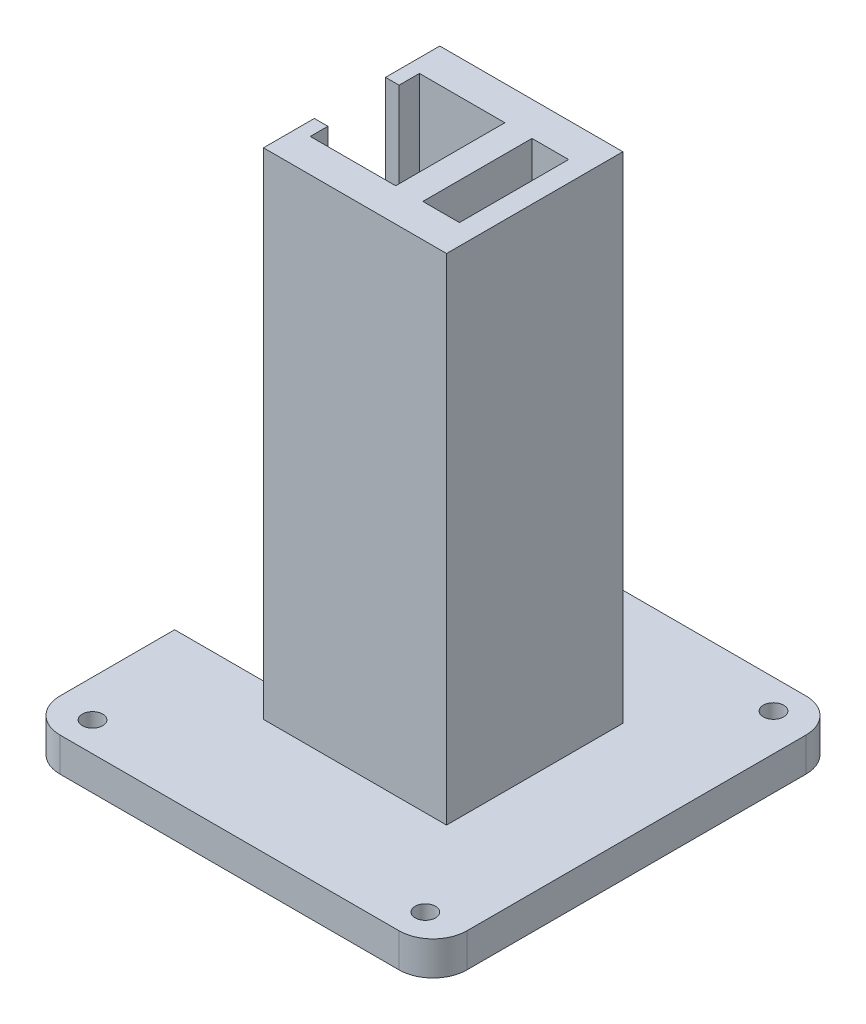
ISO-10303-21;
HEADER;
FILE_DESCRIPTION(('STEP AP214'),'2;1');
FILE_NAME('part.step','',(''),(''),'','','');
FILE_SCHEMA(('AUTOMOTIVE_DESIGN { 1 0 10303 214 1 1 1 1 }'));
ENDSEC;
DATA;
#1=APPLICATION_CONTEXT('core data for automotive mechanical design processes');
#2=APPLICATION_PROTOCOL_DEFINITION('international standard','automotive_design',2000,#1);
#3=PRODUCT_CONTEXT('',#1,'mechanical');
#4=PRODUCT('Part','Part','',(#3));
#5=PRODUCT_RELATED_PRODUCT_CATEGORY('part','',(#4));
#6=PRODUCT_DEFINITION_FORMATION('','',#4);
#7=PRODUCT_DEFINITION_CONTEXT('part definition',#1,'design');
#8=PRODUCT_DEFINITION('design','',#6,#7);
#9=PRODUCT_DEFINITION_SHAPE('','',#8);
#10=(LENGTH_UNIT() NAMED_UNIT(*) SI_UNIT(.MILLI.,.METRE.));
#11=(NAMED_UNIT(*) PLANE_ANGLE_UNIT() SI_UNIT($,.RADIAN.));
#12=(NAMED_UNIT(*) SI_UNIT($,.STERADIAN.) SOLID_ANGLE_UNIT());
#13=UNCERTAINTY_MEASURE_WITH_UNIT(LENGTH_MEASURE(1.E-05),#10,'distance_accuracy_value','');
#14=(GEOMETRIC_REPRESENTATION_CONTEXT(3) GLOBAL_UNCERTAINTY_ASSIGNED_CONTEXT((#13)) GLOBAL_UNIT_ASSIGNED_CONTEXT((#10,
#11,#12)) REPRESENTATION_CONTEXT('',''));
#15=CARTESIAN_POINT('',(0.,0.,0.));
#16=DIRECTION('',(0.,0.,1.));
#17=DIRECTION('',(1.,0.,0.));
#18=AXIS2_PLACEMENT_3D('',#15,#16,#17);
#19=CARTESIAN_POINT('',(-13.,-36.5,5.));
#20=DIRECTION('',(0.,0.,-1.));
#21=DIRECTION('',(-1.,0.,0.));
#22=AXIS2_PLACEMENT_3D('',#19,#20,#21);
#23=PLANE('',#22);
#24=DIRECTION('',(-1.,0.,0.));
#25=VECTOR('',#24,1.);
#26=CARTESIAN_POINT('',(-13.,36.5,5.));
#27=LINE('',#26,#25);
#28=CARTESIAN_POINT('',(12.,36.5,5.));
#29=VERTEX_POINT('',#28);
#30=CARTESIAN_POINT('',(6.60000000000001,36.5,5.));
#31=VERTEX_POINT('',#30);
#32=EDGE_CURVE('E459',#29,#31,#27,.T.);
#33=ORIENTED_EDGE('',*,*,#32,.T.);
#34=DIRECTION('',(0.,1.,0.));
#35=VECTOR('',#34,1.);
#36=CARTESIAN_POINT('',(6.60000000000004,-41.5,5.));
#37=LINE('',#36,#35);
#38=CARTESIAN_POINT('',(6.60000000000004,-41.5,5.));
#39=VERTEX_POINT('',#38);
#40=EDGE_CURVE('E623',#39,#31,#37,.T.);
#41=ORIENTED_EDGE('',*,*,#40,.F.);
#42=DIRECTION('',(-1.,0.,0.));
#43=VECTOR('',#42,1.);
#44=CARTESIAN_POINT('',(12.,-41.5,5.));
#45=LINE('',#44,#43);
#46=CARTESIAN_POINT('',(12.,-41.5,5.));
#47=VERTEX_POINT('',#46);
#48=EDGE_CURVE('E345',#47,#39,#45,.T.);
#49=ORIENTED_EDGE('',*,*,#48,.F.);
#50=DIRECTION('',(0.,1.,0.));
#51=VECTOR('',#50,1.);
#52=CARTESIAN_POINT('',(12.,-36.5,5.));
#53=LINE('',#52,#51);
#54=EDGE_CURVE('E464',#47,#29,#53,.T.);
#55=ORIENTED_EDGE('',*,*,#54,.T.);
#56=EDGE_LOOP('',(#33,#41,#49,#55));
#57=FACE_BOUND('',#56,.T.);
#58=ADVANCED_FACE('F39',(#57),#23,.F.);
#59=CARTESIAN_POINT('',(-13.,-36.5,21.1));
#60=DIRECTION('',(0.,0.,1.));
#61=DIRECTION('',(1.,0.,0.));
#62=AXIS2_PLACEMENT_3D('',#59,#60,#61);
#63=PLANE('',#62);
#64=DIRECTION('',(1.,0.,0.));
#65=VECTOR('',#64,1.);
#66=CARTESIAN_POINT('',(12.,-41.5,21.1));
#67=LINE('',#66,#65);
#68=CARTESIAN_POINT('',(6.60000000000004,-41.5,21.1));
#69=VERTEX_POINT('',#68);
#70=CARTESIAN_POINT('',(12.,-41.5,21.1));
#71=VERTEX_POINT('',#70);
#72=EDGE_CURVE('E249',#69,#71,#67,.T.);
#73=ORIENTED_EDGE('',*,*,#72,.F.);
#74=DIRECTION('',(0.,1.,0.));
#75=VECTOR('',#74,1.);
#76=CARTESIAN_POINT('',(6.60000000000004,-41.5,21.1));
#77=LINE('',#76,#75);
#78=CARTESIAN_POINT('',(6.60000000000001,36.5,21.1));
#79=VERTEX_POINT('',#78);
#80=EDGE_CURVE('E241',#69,#79,#77,.T.);
#81=ORIENTED_EDGE('',*,*,#80,.T.);
#82=DIRECTION('',(1.,0.,0.));
#83=VECTOR('',#82,1.);
#84=CARTESIAN_POINT('',(-13.,36.5,21.1));
#85=LINE('',#84,#83);
#86=CARTESIAN_POINT('',(12.,36.5,21.1));
#87=VERTEX_POINT('',#86);
#88=EDGE_CURVE('E451',#79,#87,#85,.T.);
#89=ORIENTED_EDGE('',*,*,#88,.T.);
#90=DIRECTION('',(0.,1.,0.));
#91=VECTOR('',#90,1.);
#92=CARTESIAN_POINT('',(12.,-36.5,21.1));
#93=LINE('',#92,#91);
#94=EDGE_CURVE('E463',#71,#87,#93,.T.);
#95=ORIENTED_EDGE('',*,*,#94,.F.);
#96=EDGE_LOOP('',(#73,#81,#89,#95));
#97=FACE_BOUND('',#96,.T.);
#98=ADVANCED_FACE('F652',(#97),#63,.F.);
#99=DIRECTION('',(0.,1.,0.));
#100=VECTOR('',#99,1.);
#101=CARTESIAN_POINT('',(-12.,-36.5,21.1));
#102=LINE('',#101,#100);
#103=CARTESIAN_POINT('',(-12.,-41.5,21.1));
#104=VERTEX_POINT('',#103);
#105=CARTESIAN_POINT('',(-12.,-36.5,21.1));
#106=VERTEX_POINT('',#105);
#107=EDGE_CURVE('E258',#104,#106,#102,.T.);
#108=ORIENTED_EDGE('',*,*,#107,.F.);
#109=CARTESIAN_POINT('',(-30.,-41.5,21.1));
#110=VERTEX_POINT('',#109);
#111=EDGE_CURVE('E248',#110,#104,#67,.T.);
#112=ORIENTED_EDGE('',*,*,#111,.F.);
#113=DIRECTION('',(0.,1.,0.));
#114=VECTOR('',#113,1.);
#115=CARTESIAN_POINT('',(-30.,-41.5,21.1));
#116=LINE('',#115,#114);
#117=CARTESIAN_POINT('',(-30.,-36.5,21.1));
#118=VERTEX_POINT('',#117);
#119=EDGE_CURVE('E254',#110,#118,#116,.T.);
#120=ORIENTED_EDGE('',*,*,#119,.T.);
#121=DIRECTION('',(1.,0.,0.));
#122=VECTOR('',#121,1.);
#123=CARTESIAN_POINT('',(12.,-36.5,21.1));
#124=LINE('',#123,#122);
#125=EDGE_CURVE('E255',#118,#106,#124,.T.);
#126=ORIENTED_EDGE('',*,*,#125,.T.);
#127=EDGE_LOOP('',(#108,#112,#120,#126));
#128=FACE_BOUND('',#127,.T.);
#129=ADVANCED_FACE('F615',(#128),#63,.F.);
#130=CARTESIAN_POINT('',(2.60000000000005,-41.5,5.));
#131=VERTEX_POINT('',#130);
#132=CARTESIAN_POINT('',(-9.99999999999999,-41.5,5.));
#133=VERTEX_POINT('',#132);
#134=EDGE_CURVE('E349',#131,#133,#45,.T.);
#135=ORIENTED_EDGE('',*,*,#134,.F.);
#136=DIRECTION('',(0.,1.,0.));
#137=VECTOR('',#136,1.);
#138=CARTESIAN_POINT('',(2.60000000000004,-41.5,5.));
#139=LINE('',#138,#137);
#140=CARTESIAN_POINT('',(2.60000000000001,36.5,5.));
#141=VERTEX_POINT('',#140);
#142=EDGE_CURVE('E228',#131,#141,#139,.T.);
#143=ORIENTED_EDGE('',*,*,#142,.T.);
#144=CARTESIAN_POINT('',(-10.,36.5,5.));
#145=VERTEX_POINT('',#144);
#146=EDGE_CURVE('E458',#141,#145,#27,.T.);
#147=ORIENTED_EDGE('',*,*,#146,.T.);
#148=DIRECTION('',(0.,1.,0.));
#149=VECTOR('',#148,1.);
#150=CARTESIAN_POINT('',(-9.99999999999999,-36.5,5.));
#151=LINE('',#150,#149);
#152=EDGE_CURVE('E432',#133,#145,#151,.T.);
#153=ORIENTED_EDGE('',*,*,#152,.F.);
#154=EDGE_LOOP('',(#135,#143,#147,#153));
#155=FACE_BOUND('',#154,.T.);
#156=ADVANCED_FACE('F656',(#155),#23,.F.);
#157=CARTESIAN_POINT('',(-30.,-41.5,43.));
#158=DIRECTION('',(1.,0.,0.));
#159=DIRECTION('',(0.,1.,0.));
#160=AXIS2_PLACEMENT_3D('',#157,#158,#159);
#161=PLANE('',#160);
#162=DIRECTION('',(0.,0.,-1.));
#163=VECTOR('',#162,1.);
#164=CARTESIAN_POINT('',(-30.,-41.5,43.));
#165=LINE('',#164,#163);
#166=CARTESIAN_POINT('',(-30.,-41.5,5.));
#167=VERTEX_POINT('',#166);
#168=CARTESIAN_POINT('',(-30.,-41.5,-12.));
#169=VERTEX_POINT('',#168);
#170=EDGE_CURVE('E423',#167,#169,#165,.T.);
#171=ORIENTED_EDGE('',*,*,#170,.F.);
#172=DIRECTION('',(0.,-1.,0.));
#173=VECTOR('',#172,1.);
#174=CARTESIAN_POINT('',(-30.,-36.5,5.));
#175=LINE('',#174,#173);
#176=CARTESIAN_POINT('',(-30.,-36.5,5.));
#177=VERTEX_POINT('',#176);
#178=EDGE_CURVE('E336',#177,#167,#175,.T.);
#179=ORIENTED_EDGE('',*,*,#178,.F.);
#180=DIRECTION('',(0.,0.,-1.));
#181=VECTOR('',#180,1.);
#182=CARTESIAN_POINT('',(-30.,-36.5,43.));
#183=LINE('',#182,#181);
#184=CARTESIAN_POINT('',(-30.,-36.5,-12.));
#185=VERTEX_POINT('',#184);
#186=EDGE_CURVE('E440',#177,#185,#183,.T.);
#187=ORIENTED_EDGE('',*,*,#186,.T.);
#188=DIRECTION('',(0.,1.,0.));
#189=VECTOR('',#188,1.);
#190=CARTESIAN_POINT('',(-30.,-41.5,-12.));
#191=LINE('',#190,#189);
#192=EDGE_CURVE('E523',#185,#169,#191,.F.);
#193=ORIENTED_EDGE('',*,*,#192,.T.);
#194=EDGE_LOOP('',(#171,#179,#187,#193));
#195=FACE_BOUND('',#194,.T.);
#196=ADVANCED_FACE('F564',(#195),#161,.F.);
#197=CARTESIAN_POINT('',(15.,-36.5,26.));
#198=DIRECTION('',(-1.,0.,0.));
#199=DIRECTION('',(0.,0.,1.));
#200=AXIS2_PLACEMENT_3D('',#197,#198,#199);
#201=PLANE('',#200);
#202=DIRECTION('',(0.,1.,0.));
#203=VECTOR('',#202,1.);
#204=CARTESIAN_POINT('',(15.,-36.5,0.));
#205=LINE('',#204,#203);
#206=CARTESIAN_POINT('',(15.,-36.5,0.));
#207=VERTEX_POINT('',#206);
#208=CARTESIAN_POINT('',(15.,36.5,0.));
#209=VERTEX_POINT('',#208);
#210=EDGE_CURVE('E485',#207,#209,#205,.T.);
#211=ORIENTED_EDGE('',*,*,#210,.T.);
#212=DIRECTION('',(0.,0.,-1.));
#213=VECTOR('',#212,1.);
#214=CARTESIAN_POINT('',(15.,36.5,26.));
#215=LINE('',#214,#213);
#216=CARTESIAN_POINT('',(15.,36.5,26.));
#217=VERTEX_POINT('',#216);
#218=EDGE_CURVE('E481',#217,#209,#215,.T.);
#219=ORIENTED_EDGE('',*,*,#218,.F.);
#220=DIRECTION('',(0.,1.,0.));
#221=VECTOR('',#220,1.);
#222=CARTESIAN_POINT('',(15.,-36.5,26.));
#223=LINE('',#222,#221);
#224=CARTESIAN_POINT('',(15.,-36.5,26.));
#225=VERTEX_POINT('',#224);
#226=EDGE_CURVE('E474',#225,#217,#223,.T.);
#227=ORIENTED_EDGE('',*,*,#226,.F.);
#228=DIRECTION('',(0.,0.,-1.));
#229=VECTOR('',#228,1.);
#230=CARTESIAN_POINT('',(15.,-36.5,26.));
#231=LINE('',#230,#229);
#232=EDGE_CURVE('E493',#225,#207,#231,.T.);
#233=ORIENTED_EDGE('',*,*,#232,.T.);
#234=EDGE_LOOP('',(#211,#219,#227,#233));
#235=FACE_BOUND('',#234,.T.);
#236=ADVANCED_FACE('F595',(#235),#201,.F.);
#237=CARTESIAN_POINT('',(15.,36.5,26.));
#238=DIRECTION('',(0.,-1.,0.));
#239=DIRECTION('',(1.,0.,0.));
#240=AXIS2_PLACEMENT_3D('',#237,#238,#239);
#241=PLANE('',#240);
#242=ORIENTED_EDGE('',*,*,#146,.F.);
#243=DIRECTION('',(0.,0.,1.));
#244=VECTOR('',#243,1.);
#245=CARTESIAN_POINT('',(2.60000000000001,36.5,5.));
#246=LINE('',#245,#244);
#247=CARTESIAN_POINT('',(2.60000000000001,36.5,21.1));
#248=VERTEX_POINT('',#247);
#249=EDGE_CURVE('E638',#141,#248,#246,.T.);
#250=ORIENTED_EDGE('',*,*,#249,.T.);
#251=CARTESIAN_POINT('',(-9.99999999999999,36.5,21.1));
#252=VERTEX_POINT('',#251);
#253=EDGE_CURVE('E239',#252,#248,#85,.T.);
#254=ORIENTED_EDGE('',*,*,#253,.F.);
#255=DIRECTION('',(0.,0.,-1.));
#256=VECTOR('',#255,1.);
#257=CARTESIAN_POINT('',(-9.99999999999999,36.5,18.5));
#258=LINE('',#257,#256);
#259=CARTESIAN_POINT('',(-9.99999999999999,36.5,18.5));
#260=VERTEX_POINT('',#259);
#261=EDGE_CURVE('E264',#252,#260,#258,.T.);
#262=ORIENTED_EDGE('',*,*,#261,.T.);
#263=DIRECTION('',(-1.,0.,0.));
#264=VECTOR('',#263,1.);
#265=CARTESIAN_POINT('',(-12.,36.5,18.5));
#266=LINE('',#265,#264);
#267=CARTESIAN_POINT('',(-12.,36.5,18.5));
#268=VERTEX_POINT('',#267);
#269=EDGE_CURVE('E278',#260,#268,#266,.T.);
#270=ORIENTED_EDGE('',*,*,#269,.T.);
#271=DIRECTION('',(0.,0.,1.));
#272=VECTOR('',#271,1.);
#273=CARTESIAN_POINT('',(-12.,36.5,26.));
#274=LINE('',#273,#272);
#275=CARTESIAN_POINT('',(-12.,36.5,26.));
#276=VERTEX_POINT('',#275);
#277=EDGE_CURVE('E268',#268,#276,#274,.T.);
#278=ORIENTED_EDGE('',*,*,#277,.T.);
#279=DIRECTION('',(-1.,0.,0.));
#280=VECTOR('',#279,1.);
#281=CARTESIAN_POINT('',(15.,36.5,26.));
#282=LINE('',#281,#280);
#283=EDGE_CURVE('E478',#217,#276,#282,.T.);
#284=ORIENTED_EDGE('',*,*,#283,.F.);
#285=ORIENTED_EDGE('',*,*,#218,.T.);
#286=DIRECTION('',(-1.,0.,0.));
#287=VECTOR('',#286,1.);
#288=CARTESIAN_POINT('',(15.,36.5,0.));
#289=LINE('',#288,#287);
#290=CARTESIAN_POINT('',(-12.,36.5,0.));
#291=VERTEX_POINT('',#290);
#292=EDGE_CURVE('E475',#209,#291,#289,.T.);
#293=ORIENTED_EDGE('',*,*,#292,.T.);
#294=DIRECTION('',(0.,0.,1.));
#295=VECTOR('',#294,1.);
#296=CARTESIAN_POINT('',(-12.,36.5,0.));
#297=LINE('',#296,#295);
#298=CARTESIAN_POINT('',(-12.,36.5,8.));
#299=VERTEX_POINT('',#298);
#300=EDGE_CURVE('E316',#291,#299,#297,.T.);
#301=ORIENTED_EDGE('',*,*,#300,.T.);
#302=DIRECTION('',(1.,0.,0.));
#303=VECTOR('',#302,1.);
#304=CARTESIAN_POINT('',(-12.,36.5,8.));
#305=LINE('',#304,#303);
#306=CARTESIAN_POINT('',(-10.,36.5,8.));
#307=VERTEX_POINT('',#306);
#308=EDGE_CURVE('E305',#299,#307,#305,.T.);
#309=ORIENTED_EDGE('',*,*,#308,.T.);
#310=DIRECTION('',(0.,0.,-1.));
#311=VECTOR('',#310,1.);
#312=CARTESIAN_POINT('',(-10.,36.5,8.));
#313=LINE('',#312,#311);
#314=EDGE_CURVE('E299',#307,#145,#313,.T.);
#315=ORIENTED_EDGE('',*,*,#314,.T.);
#316=EDGE_LOOP('',(#242,#250,#254,#262,#270,#278,#284,#285,#293,#301,#309,#315));
#317=FACE_BOUND('',#316,.T.);
#318=DIRECTION('',(0.,0.,-1.));
#319=VECTOR('',#318,1.);
#320=CARTESIAN_POINT('',(6.60000000000001,36.5,5.));
#321=LINE('',#320,#319);
#322=EDGE_CURVE('E231',#79,#31,#321,.T.);
#323=ORIENTED_EDGE('',*,*,#322,.T.);
#324=ORIENTED_EDGE('',*,*,#32,.F.);
#325=DIRECTION('',(0.,0.,-1.));
#326=VECTOR('',#325,1.);
#327=CARTESIAN_POINT('',(12.,36.5,5.));
#328=LINE('',#327,#326);
#329=EDGE_CURVE('E454',#87,#29,#328,.T.);
#330=ORIENTED_EDGE('',*,*,#329,.F.);
#331=ORIENTED_EDGE('',*,*,#88,.F.);
#332=EDGE_LOOP('',(#323,#324,#330,#331));
#333=FACE_BOUND('',#332,.T.);
#334=ADVANCED_FACE('F584',(#317,#333),#241,.F.);
#335=CARTESIAN_POINT('',(0.,0.,26.));
#336=DIRECTION('',(0.,0.,1.));
#337=DIRECTION('',(1.,0.,0.));
#338=AXIS2_PLACEMENT_3D('',#335,#336,#337);
#339=PLANE('',#338);
#340=ORIENTED_EDGE('',*,*,#283,.T.);
#341=DIRECTION('',(0.,1.,0.));
#342=VECTOR('',#341,1.);
#343=CARTESIAN_POINT('',(-12.,-41.5,26.));
#344=LINE('',#343,#342);
#345=CARTESIAN_POINT('',(-12.,-36.5,26.));
#346=VERTEX_POINT('',#345);
#347=EDGE_CURVE('E285',#346,#276,#344,.T.);
#348=ORIENTED_EDGE('',*,*,#347,.F.);
#349=DIRECTION('',(1.,0.,0.));
#350=VECTOR('',#349,1.);
#351=CARTESIAN_POINT('',(15.,-36.5,26.));
#352=LINE('',#351,#350);
#353=EDGE_CURVE('E471',#346,#225,#352,.T.);
#354=ORIENTED_EDGE('',*,*,#353,.T.);
#355=ORIENTED_EDGE('',*,*,#226,.T.);
#356=EDGE_LOOP('',(#340,#348,#354,#355));
#357=FACE_BOUND('',#356,.T.);
#358=ADVANCED_FACE('F599',(#357),#339,.T.);
#359=CARTESIAN_POINT('',(0.,0.,0.));
#360=DIRECTION('',(0.,0.,1.));
#361=DIRECTION('',(1.,0.,0.));
#362=AXIS2_PLACEMENT_3D('',#359,#360,#361);
#363=PLANE('',#362);
#364=CARTESIAN_POINT('',(7.,31.5,0.));
#365=DIRECTION('',(0.,0.,-1.));
#366=DIRECTION('',(-1.,0.,0.));
#367=AXIS2_PLACEMENT_3D('',#364,#365,#366);
#368=CIRCLE('',#367,1.);
#369=CARTESIAN_POINT('',(6.,31.5,0.));
#370=VERTEX_POINT('',#369);
#371=EDGE_CURVE('E355',#370,#370,#368,.T.);
#372=ORIENTED_EDGE('',*,*,#371,.F.);
#373=EDGE_LOOP('',(#372));
#374=FACE_BOUND('',#373,.T.);
#375=CARTESIAN_POINT('',(12.,24.5,0.));
#376=DIRECTION('',(0.,0.,-1.));
#377=DIRECTION('',(-1.,0.,0.));
#378=AXIS2_PLACEMENT_3D('',#375,#376,#377);
#379=CIRCLE('',#378,1.);
#380=CARTESIAN_POINT('',(11.,24.5,0.));
#381=VERTEX_POINT('',#380);
#382=EDGE_CURVE('E363',#381,#381,#379,.T.);
#383=ORIENTED_EDGE('',*,*,#382,.F.);
#384=EDGE_LOOP('',(#383));
#385=FACE_BOUND('',#384,.T.);
#386=CARTESIAN_POINT('',(2.,24.5,0.));
#387=DIRECTION('',(0.,0.,-1.));
#388=DIRECTION('',(-1.,0.,0.));
#389=AXIS2_PLACEMENT_3D('',#386,#387,#388);
#390=CIRCLE('',#389,1.);
#391=CARTESIAN_POINT('',(1.,24.5,0.));
#392=VERTEX_POINT('',#391);
#393=EDGE_CURVE('E371',#392,#392,#390,.T.);
#394=ORIENTED_EDGE('',*,*,#393,.F.);
#395=EDGE_LOOP('',(#394));
#396=FACE_BOUND('',#395,.T.);
#397=CARTESIAN_POINT('',(7.,18.5,0.));
#398=DIRECTION('',(0.,0.,-1.));
#399=DIRECTION('',(-1.,0.,0.));
#400=AXIS2_PLACEMENT_3D('',#397,#398,#399);
#401=CIRCLE('',#400,1.);
#402=CARTESIAN_POINT('',(6.,18.5,0.));
#403=VERTEX_POINT('',#402);
#404=EDGE_CURVE('E348',#403,#403,#401,.T.);
#405=ORIENTED_EDGE('',*,*,#404,.F.);
#406=EDGE_LOOP('',(#405));
#407=FACE_BOUND('',#406,.T.);
#408=DIRECTION('',(1.,0.,0.));
#409=VECTOR('',#408,1.);
#410=CARTESIAN_POINT('',(15.,-36.5,0.));
#411=LINE('',#410,#409);
#412=CARTESIAN_POINT('',(-12.,-36.5,0.));
#413=VERTEX_POINT('',#412);
#414=EDGE_CURVE('E467',#413,#207,#411,.T.);
#415=ORIENTED_EDGE('',*,*,#414,.F.);
#416=DIRECTION('',(0.,1.,0.));
#417=VECTOR('',#416,1.);
#418=CARTESIAN_POINT('',(-12.,-41.5,0.));
#419=LINE('',#418,#417);
#420=EDGE_CURVE('E312',#413,#291,#419,.T.);
#421=ORIENTED_EDGE('',*,*,#420,.T.);
#422=ORIENTED_EDGE('',*,*,#292,.F.);
#423=ORIENTED_EDGE('',*,*,#210,.F.);
#424=EDGE_LOOP('',(#415,#421,#422,#423));
#425=FACE_BOUND('',#424,.T.);
#426=ADVANCED_FACE('F589',(#374,#385,#396,#407,#425),#363,.F.);
#427=CARTESIAN_POINT('',(-12.,-41.5,5.));
#428=VERTEX_POINT('',#427);
#429=EDGE_CURVE('E341',#428,#167,#45,.T.);
#430=ORIENTED_EDGE('',*,*,#429,.F.);
#431=DIRECTION('',(0.,1.,0.));
#432=VECTOR('',#431,1.);
#433=CARTESIAN_POINT('',(-12.,-36.5,5.));
#434=LINE('',#433,#432);
#435=CARTESIAN_POINT('',(-12.,-36.5,5.));
#436=VERTEX_POINT('',#435);
#437=EDGE_CURVE('E326',#428,#436,#434,.T.);
#438=ORIENTED_EDGE('',*,*,#437,.T.);
#439=DIRECTION('',(1.,0.,0.));
#440=VECTOR('',#439,1.);
#441=CARTESIAN_POINT('',(0.,-36.5,5.));
#442=LINE('',#441,#440);
#443=EDGE_CURVE('E48',#177,#436,#442,.T.);
#444=ORIENTED_EDGE('',*,*,#443,.F.);
#445=ORIENTED_EDGE('',*,*,#178,.T.);
#446=EDGE_LOOP('',(#430,#438,#444,#445));
#447=FACE_BOUND('',#446,.T.);
#448=ADVANCED_FACE('F561',(#447),#23,.F.);
#449=CARTESIAN_POINT('',(12.,-36.5,5.));
#450=DIRECTION('',(1.,0.,0.));
#451=DIRECTION('',(0.,1.,0.));
#452=AXIS2_PLACEMENT_3D('',#449,#450,#451);
#453=PLANE('',#452);
#454=ORIENTED_EDGE('',*,*,#329,.T.);
#455=ORIENTED_EDGE('',*,*,#54,.F.);
#456=DIRECTION('',(0.,0.,1.));
#457=VECTOR('',#456,1.);
#458=CARTESIAN_POINT('',(12.,-41.5,5.));
#459=LINE('',#458,#457);
#460=EDGE_CURVE('E337',#47,#71,#459,.T.);
#461=ORIENTED_EDGE('',*,*,#460,.T.);
#462=ORIENTED_EDGE('',*,*,#94,.T.);
#463=EDGE_LOOP('',(#454,#455,#461,#462));
#464=FACE_BOUND('',#463,.T.);
#465=ADVANCED_FACE('F648',(#464),#453,.F.);
#466=ORIENTED_EDGE('',*,*,#253,.T.);
#467=DIRECTION('',(0.,1.,0.));
#468=VECTOR('',#467,1.);
#469=CARTESIAN_POINT('',(2.60000000000004,-41.5,21.1));
#470=LINE('',#469,#468);
#471=CARTESIAN_POINT('',(2.60000000000004,-41.5,21.1));
#472=VERTEX_POINT('',#471);
#473=EDGE_CURVE('E225',#472,#248,#470,.T.);
#474=ORIENTED_EDGE('',*,*,#473,.F.);
#475=CARTESIAN_POINT('',(-9.99999999999996,-41.5,21.1));
#476=VERTEX_POINT('',#475);
#477=EDGE_CURVE('E237',#476,#472,#67,.T.);
#478=ORIENTED_EDGE('',*,*,#477,.F.);
#479=DIRECTION('',(0.,-1.,0.));
#480=VECTOR('',#479,1.);
#481=CARTESIAN_POINT('',(-9.99999999999999,-36.5,21.1));
#482=LINE('',#481,#480);
#483=EDGE_CURVE('E496',#252,#476,#482,.T.);
#484=ORIENTED_EDGE('',*,*,#483,.F.);
#485=EDGE_LOOP('',(#466,#474,#478,#484));
#486=FACE_BOUND('',#485,.T.);
#487=ADVANCED_FACE('F236',(#486),#63,.F.);
#488=CARTESIAN_POINT('',(30.,-41.5,43.));
#489=DIRECTION('',(-1.,0.,0.));
#490=DIRECTION('',(0.,-1.,0.));
#491=AXIS2_PLACEMENT_3D('',#488,#489,#490);
#492=PLANE('',#491);
#493=DIRECTION('',(0.,0.,1.));
#494=VECTOR('',#493,1.);
#495=CARTESIAN_POINT('',(30.,-41.5,43.));
#496=LINE('',#495,#494);
#497=CARTESIAN_POINT('',(30.,-41.5,-12.));
#498=VERTEX_POINT('',#497);
#499=CARTESIAN_POINT('',(30.,-41.5,38.));
#500=VERTEX_POINT('',#499);
#501=EDGE_CURVE('E414',#498,#500,#496,.T.);
#502=ORIENTED_EDGE('',*,*,#501,.F.);
#503=DIRECTION('',(0.,1.,0.));
#504=VECTOR('',#503,1.);
#505=CARTESIAN_POINT('',(30.,-41.5,-12.));
#506=LINE('',#505,#504);
#507=CARTESIAN_POINT('',(30.,-36.5,-12.));
#508=VERTEX_POINT('',#507);
#509=EDGE_CURVE('E542',#498,#508,#506,.T.);
#510=ORIENTED_EDGE('',*,*,#509,.T.);
#511=DIRECTION('',(0.,0.,1.));
#512=VECTOR('',#511,1.);
#513=CARTESIAN_POINT('',(30.,-36.5,43.));
#514=LINE('',#513,#512);
#515=CARTESIAN_POINT('',(30.,-36.5,38.));
#516=VERTEX_POINT('',#515);
#517=EDGE_CURVE('E410',#508,#516,#514,.T.);
#518=ORIENTED_EDGE('',*,*,#517,.T.);
#519=DIRECTION('',(0.,1.,0.));
#520=VECTOR('',#519,1.);
#521=CARTESIAN_POINT('',(30.,-41.5,38.));
#522=LINE('',#521,#520);
#523=EDGE_CURVE('E539',#516,#500,#522,.F.);
#524=ORIENTED_EDGE('',*,*,#523,.T.);
#525=EDGE_LOOP('',(#502,#510,#518,#524));
#526=FACE_BOUND('',#525,.T.);
#527=ADVANCED_FACE('F723',(#526),#492,.F.);
#528=CARTESIAN_POINT('',(-30.,-41.5,43.));
#529=DIRECTION('',(0.,0.,-1.));
#530=DIRECTION('',(-1.,0.,0.));
#531=AXIS2_PLACEMENT_3D('',#528,#529,#530);
#532=PLANE('',#531);
#533=DIRECTION('',(-1.,0.,0.));
#534=VECTOR('',#533,1.);
#535=CARTESIAN_POINT('',(-30.,-41.5,43.));
#536=LINE('',#535,#534);
#537=CARTESIAN_POINT('',(25.,-41.5,43.));
#538=VERTEX_POINT('',#537);
#539=CARTESIAN_POINT('',(-25.,-41.5,43.));
#540=VERTEX_POINT('',#539);
#541=EDGE_CURVE('E418',#538,#540,#536,.T.);
#542=ORIENTED_EDGE('',*,*,#541,.F.);
#543=DIRECTION('',(0.,1.,0.));
#544=VECTOR('',#543,1.);
#545=CARTESIAN_POINT('',(25.,-41.5,43.));
#546=LINE('',#545,#544);
#547=CARTESIAN_POINT('',(25.,-36.5,43.));
#548=VERTEX_POINT('',#547);
#549=EDGE_CURVE('E549',#538,#548,#546,.T.);
#550=ORIENTED_EDGE('',*,*,#549,.T.);
#551=DIRECTION('',(-1.,0.,0.));
#552=VECTOR('',#551,1.);
#553=CARTESIAN_POINT('',(-30.,-36.5,43.));
#554=LINE('',#553,#552);
#555=CARTESIAN_POINT('',(-25.,-36.5,43.));
#556=VERTEX_POINT('',#555);
#557=EDGE_CURVE('E436',#548,#556,#554,.T.);
#558=ORIENTED_EDGE('',*,*,#557,.T.);
#559=DIRECTION('',(0.,1.,0.));
#560=VECTOR('',#559,1.);
#561=CARTESIAN_POINT('',(-25.,-41.5,43.));
#562=LINE('',#561,#560);
#563=EDGE_CURVE('E546',#556,#540,#562,.F.);
#564=ORIENTED_EDGE('',*,*,#563,.T.);
#565=EDGE_LOOP('',(#542,#550,#558,#564));
#566=FACE_BOUND('',#565,.T.);
#567=ADVANCED_FACE('F719',(#566),#532,.F.);
#568=CARTESIAN_POINT('',(-30.,-36.5,38.));
#569=VERTEX_POINT('',#568);
#570=EDGE_CURVE('E441',#569,#118,#183,.T.);
#571=ORIENTED_EDGE('',*,*,#570,.T.);
#572=ORIENTED_EDGE('',*,*,#119,.F.);
#573=CARTESIAN_POINT('',(-30.,-41.5,38.));
#574=VERTEX_POINT('',#573);
#575=EDGE_CURVE('E424',#574,#110,#165,.T.);
#576=ORIENTED_EDGE('',*,*,#575,.F.);
#577=DIRECTION('',(0.,1.,0.));
#578=VECTOR('',#577,1.);
#579=CARTESIAN_POINT('',(-30.,-41.5,38.));
#580=LINE('',#579,#578);
#581=EDGE_CURVE('E519',#574,#569,#580,.T.);
#582=ORIENTED_EDGE('',*,*,#581,.T.);
#583=EDGE_LOOP('',(#571,#572,#576,#582));
#584=FACE_BOUND('',#583,.T.);
#585=ADVANCED_FACE('F618',(#584),#161,.F.);
#586=CARTESIAN_POINT('',(-30.,-41.5,-17.));
#587=DIRECTION('',(0.,0.,1.));
#588=DIRECTION('',(1.,0.,0.));
#589=AXIS2_PLACEMENT_3D('',#586,#587,#588);
#590=PLANE('',#589);
#591=DIRECTION('',(1.,0.,0.));
#592=VECTOR('',#591,1.);
#593=CARTESIAN_POINT('',(-30.,-41.5,-17.));
#594=LINE('',#593,#592);
#595=CARTESIAN_POINT('',(-25.,-41.5,-17.));
#596=VERTEX_POINT('',#595);
#597=CARTESIAN_POINT('',(25.,-41.5,-17.));
#598=VERTEX_POINT('',#597);
#599=EDGE_CURVE('E428',#596,#598,#594,.T.);
#600=ORIENTED_EDGE('',*,*,#599,.F.);
#601=DIRECTION('',(0.,1.,0.));
#602=VECTOR('',#601,1.);
#603=CARTESIAN_POINT('',(-25.,-41.5,-17.));
#604=LINE('',#603,#602);
#605=CARTESIAN_POINT('',(-25.,-36.5,-17.));
#606=VERTEX_POINT('',#605);
#607=EDGE_CURVE('E502',#596,#606,#604,.T.);
#608=ORIENTED_EDGE('',*,*,#607,.T.);
#609=DIRECTION('',(1.,0.,0.));
#610=VECTOR('',#609,1.);
#611=CARTESIAN_POINT('',(-30.,-36.5,-17.));
#612=LINE('',#611,#610);
#613=CARTESIAN_POINT('',(25.,-36.5,-17.));
#614=VERTEX_POINT('',#613);
#615=EDGE_CURVE('E419',#606,#614,#612,.T.);
#616=ORIENTED_EDGE('',*,*,#615,.T.);
#617=DIRECTION('',(0.,1.,0.));
#618=VECTOR('',#617,1.);
#619=CARTESIAN_POINT('',(25.,-41.5,-17.));
#620=LINE('',#619,#618);
#621=EDGE_CURVE('E499',#614,#598,#620,.F.);
#622=ORIENTED_EDGE('',*,*,#621,.T.);
#623=EDGE_LOOP('',(#600,#608,#616,#622));
#624=FACE_BOUND('',#623,.T.);
#625=ADVANCED_FACE('F730',(#624),#590,.F.);
#626=CARTESIAN_POINT('',(0.,-41.5,0.));
#627=DIRECTION('',(0.,-1.,0.));
#628=DIRECTION('',(1.,0.,0.));
#629=AXIS2_PLACEMENT_3D('',#626,#627,#628);
#630=PLANE('',#629);
#631=DIRECTION('',(0.,0.,1.));
#632=VECTOR('',#631,1.);
#633=CARTESIAN_POINT('',(2.60000000000004,-41.5,5.));
#634=LINE('',#633,#632);
#635=EDGE_CURVE('E55',#131,#472,#634,.T.);
#636=ORIENTED_EDGE('',*,*,#635,.F.);
#637=ORIENTED_EDGE('',*,*,#134,.T.);
#638=DIRECTION('',(0.,0.,-1.));
#639=VECTOR('',#638,1.);
#640=CARTESIAN_POINT('',(-9.99999999999999,-41.5,8.));
#641=LINE('',#640,#639);
#642=CARTESIAN_POINT('',(-9.99999999999999,-41.5,8.));
#643=VERTEX_POINT('',#642);
#644=EDGE_CURVE('E300',#643,#133,#641,.T.);
#645=ORIENTED_EDGE('',*,*,#644,.F.);
#646=DIRECTION('',(1.,0.,0.));
#647=VECTOR('',#646,1.);
#648=CARTESIAN_POINT('',(-12.,-41.5,8.));
#649=LINE('',#648,#647);
#650=CARTESIAN_POINT('',(-12.,-41.5,8.));
#651=VERTEX_POINT('',#650);
#652=EDGE_CURVE('E308',#651,#643,#649,.T.);
#653=ORIENTED_EDGE('',*,*,#652,.F.);
#654=DIRECTION('',(0.,0.,1.));
#655=VECTOR('',#654,1.);
#656=CARTESIAN_POINT('',(-12.,-41.5,0.));
#657=LINE('',#656,#655);
#658=EDGE_CURVE('E304',#428,#651,#657,.T.);
#659=ORIENTED_EDGE('',*,*,#658,.F.);
#660=ORIENTED_EDGE('',*,*,#429,.T.);
#661=ORIENTED_EDGE('',*,*,#170,.T.);
#662=CARTESIAN_POINT('',(-25.,-41.5,-12.));
#663=DIRECTION('',(0.,-1.,0.));
#664=DIRECTION('',(1.,0.,0.));
#665=AXIS2_PLACEMENT_3D('',#662,#663,#664);
#666=CIRCLE('',#665,5.);
#667=EDGE_CURVE('E536',#169,#596,#666,.T.);
#668=ORIENTED_EDGE('',*,*,#667,.T.);
#669=ORIENTED_EDGE('',*,*,#599,.T.);
#670=CARTESIAN_POINT('',(25.,-41.5,-12.));
#671=DIRECTION('',(0.,-1.,0.));
#672=DIRECTION('',(1.,0.,0.));
#673=AXIS2_PLACEMENT_3D('',#670,#671,#672);
#674=CIRCLE('',#673,5.);
#675=EDGE_CURVE('E533',#598,#498,#674,.T.);
#676=ORIENTED_EDGE('',*,*,#675,.T.);
#677=ORIENTED_EDGE('',*,*,#501,.T.);
#678=CARTESIAN_POINT('',(25.,-41.5,38.));
#679=DIRECTION('',(0.,-1.,0.));
#680=DIRECTION('',(1.,0.,0.));
#681=AXIS2_PLACEMENT_3D('',#678,#679,#680);
#682=CIRCLE('',#681,5.);
#683=EDGE_CURVE('E530',#500,#538,#682,.T.);
#684=ORIENTED_EDGE('',*,*,#683,.T.);
#685=ORIENTED_EDGE('',*,*,#541,.T.);
#686=CARTESIAN_POINT('',(-25.,-41.5,38.));
#687=DIRECTION('',(0.,-1.,0.));
#688=DIRECTION('',(1.,0.,0.));
#689=AXIS2_PLACEMENT_3D('',#686,#687,#688);
#690=CIRCLE('',#689,5.);
#691=EDGE_CURVE('E527',#540,#574,#690,.T.);
#692=ORIENTED_EDGE('',*,*,#691,.T.);
#693=ORIENTED_EDGE('',*,*,#575,.T.);
#694=ORIENTED_EDGE('',*,*,#111,.T.);
#695=DIRECTION('',(0.,0.,1.));
#696=VECTOR('',#695,1.);
#697=CARTESIAN_POINT('',(-12.,-41.5,26.));
#698=LINE('',#697,#696);
#699=CARTESIAN_POINT('',(-12.,-41.5,18.5));
#700=VERTEX_POINT('',#699);
#701=EDGE_CURVE('E272',#700,#104,#698,.T.);
#702=ORIENTED_EDGE('',*,*,#701,.F.);
#703=DIRECTION('',(-1.,0.,0.));
#704=VECTOR('',#703,1.);
#705=CARTESIAN_POINT('',(-12.,-41.5,18.5));
#706=LINE('',#705,#704);
#707=CARTESIAN_POINT('',(-9.99999999999996,-41.5,18.5));
#708=VERTEX_POINT('',#707);
#709=EDGE_CURVE('E267',#708,#700,#706,.T.);
#710=ORIENTED_EDGE('',*,*,#709,.F.);
#711=DIRECTION('',(0.,0.,-1.));
#712=VECTOR('',#711,1.);
#713=CARTESIAN_POINT('',(-9.99999999999996,-41.5,18.5));
#714=LINE('',#713,#712);
#715=EDGE_CURVE('E245',#476,#708,#714,.T.);
#716=ORIENTED_EDGE('',*,*,#715,.F.);
#717=ORIENTED_EDGE('',*,*,#477,.T.);
#718=EDGE_LOOP('',(#636,#637,#645,#653,#659,#660,#661,#668,#669,#676,#677,#684,#685,#692,#693,
#694,#702,#710,#716,#717));
#719=FACE_BOUND('',#718,.T.);
#720=ORIENTED_EDGE('',*,*,#48,.T.);
#721=DIRECTION('',(0.,0.,-1.));
#722=VECTOR('',#721,1.);
#723=CARTESIAN_POINT('',(6.60000000000004,-41.5,5.));
#724=LINE('',#723,#722);
#725=EDGE_CURVE('E63',#69,#39,#724,.T.);
#726=ORIENTED_EDGE('',*,*,#725,.F.);
#727=ORIENTED_EDGE('',*,*,#72,.T.);
#728=ORIENTED_EDGE('',*,*,#460,.F.);
#729=EDGE_LOOP('',(#720,#726,#727,#728));
#730=FACE_BOUND('',#729,.T.);
#731=CARTESIAN_POINT('',(24.5405148538834,-41.5,-12.67154821603));
#732=DIRECTION('',(0.,1.,0.));
#733=DIRECTION('',(1.,0.,0.));
#734=AXIS2_PLACEMENT_3D('',#731,#732,#733);
#735=CIRCLE('',#734,1.5);
#736=CARTESIAN_POINT('',(26.0405148538834,-41.5,-12.67154821603));
#737=VERTEX_POINT('',#736);
#738=EDGE_CURVE('E390',#737,#737,#735,.T.);
#739=ORIENTED_EDGE('',*,*,#738,.T.);
#740=EDGE_LOOP('',(#739));
#741=FACE_BOUND('',#740,.T.);
#742=CARTESIAN_POINT('',(-24.5405148538834,-41.5,38.6715482160301));
#743=DIRECTION('',(0.,1.,0.));
#744=DIRECTION('',(1.,0.,0.));
#745=AXIS2_PLACEMENT_3D('',#742,#743,#744);
#746=CIRCLE('',#745,1.5);
#747=CARTESIAN_POINT('',(-23.0405148538834,-41.5,38.6715482160301));
#748=VERTEX_POINT('',#747);
#749=EDGE_CURVE('E399',#748,#748,#746,.T.);
#750=ORIENTED_EDGE('',*,*,#749,.T.);
#751=EDGE_LOOP('',(#750));
#752=FACE_BOUND('',#751,.T.);
#753=CARTESIAN_POINT('',(24.5405148538835,-41.5,38.67154821603));
#754=DIRECTION('',(0.,1.,0.));
#755=DIRECTION('',(-1.,0.,0.));
#756=AXIS2_PLACEMENT_3D('',#753,#754,#755);
#757=CIRCLE('',#756,1.5);
#758=CARTESIAN_POINT('',(23.0405148538835,-41.5,38.67154821603));
#759=VERTEX_POINT('',#758);
#760=EDGE_CURVE('E382',#759,#759,#757,.T.);
#761=ORIENTED_EDGE('',*,*,#760,.T.);
#762=EDGE_LOOP('',(#761));
#763=FACE_BOUND('',#762,.T.);
#764=CARTESIAN_POINT('',(-24.5405148538834,-41.5,-12.67154821603));
#765=DIRECTION('',(0.,1.,0.));
#766=DIRECTION('',(-1.,0.,0.));
#767=AXIS2_PLACEMENT_3D('',#764,#765,#766);
#768=CIRCLE('',#767,1.5);
#769=CARTESIAN_POINT('',(-26.0405148538834,-41.5,-12.67154821603));
#770=VERTEX_POINT('',#769);
#771=EDGE_CURVE('E406',#770,#770,#768,.T.);
#772=ORIENTED_EDGE('',*,*,#771,.T.);
#773=EDGE_LOOP('',(#772));
#774=FACE_BOUND('',#773,.T.);
#775=ADVANCED_FACE('F243',(#719,#730,#741,#752,#763,#774),#630,.T.);
#776=CARTESIAN_POINT('',(0.,-36.5,0.));
#777=DIRECTION('',(0.,-1.,0.));
#778=DIRECTION('',(1.,0.,0.));
#779=AXIS2_PLACEMENT_3D('',#776,#777,#778);
#780=PLANE('',#779);
#781=DIRECTION('',(0.,0.,-1.));
#782=VECTOR('',#781,1.);
#783=CARTESIAN_POINT('',(-12.,-36.5,0.));
#784=LINE('',#783,#782);
#785=EDGE_CURVE('E289',#346,#106,#784,.T.);
#786=ORIENTED_EDGE('',*,*,#785,.T.);
#787=ORIENTED_EDGE('',*,*,#125,.F.);
#788=ORIENTED_EDGE('',*,*,#570,.F.);
#789=CARTESIAN_POINT('',(-25.,-36.5,38.));
#790=DIRECTION('',(0.,-1.,0.));
#791=DIRECTION('',(1.,0.,0.));
#792=AXIS2_PLACEMENT_3D('',#789,#790,#791);
#793=CIRCLE('',#792,5.);
#794=EDGE_CURVE('E506',#569,#556,#793,.F.);
#795=ORIENTED_EDGE('',*,*,#794,.T.);
#796=ORIENTED_EDGE('',*,*,#557,.F.);
#797=CARTESIAN_POINT('',(25.,-36.5,38.));
#798=DIRECTION('',(0.,-1.,0.));
#799=DIRECTION('',(1.,0.,0.));
#800=AXIS2_PLACEMENT_3D('',#797,#798,#799);
#801=CIRCLE('',#800,5.);
#802=EDGE_CURVE('E509',#548,#516,#801,.F.);
#803=ORIENTED_EDGE('',*,*,#802,.T.);
#804=ORIENTED_EDGE('',*,*,#517,.F.);
#805=CARTESIAN_POINT('',(25.,-36.5,-12.));
#806=DIRECTION('',(0.,-1.,0.));
#807=DIRECTION('',(1.,0.,0.));
#808=AXIS2_PLACEMENT_3D('',#805,#806,#807);
#809=CIRCLE('',#808,5.);
#810=EDGE_CURVE('E512',#508,#614,#809,.F.);
#811=ORIENTED_EDGE('',*,*,#810,.T.);
#812=ORIENTED_EDGE('',*,*,#615,.F.);
#813=CARTESIAN_POINT('',(-25.,-36.5,-12.));
#814=DIRECTION('',(0.,-1.,0.));
#815=DIRECTION('',(1.,0.,0.));
#816=AXIS2_PLACEMENT_3D('',#813,#814,#815);
#817=CIRCLE('',#816,5.);
#818=EDGE_CURVE('E515',#606,#185,#817,.F.);
#819=ORIENTED_EDGE('',*,*,#818,.T.);
#820=ORIENTED_EDGE('',*,*,#186,.F.);
#821=ORIENTED_EDGE('',*,*,#443,.T.);
#822=DIRECTION('',(0.,0.,-1.));
#823=VECTOR('',#822,1.);
#824=CARTESIAN_POINT('',(-12.,-36.5,0.));
#825=LINE('',#824,#823);
#826=EDGE_CURVE('E11',#436,#413,#825,.T.);
#827=ORIENTED_EDGE('',*,*,#826,.T.);
#828=ORIENTED_EDGE('',*,*,#414,.T.);
#829=ORIENTED_EDGE('',*,*,#232,.F.);
#830=ORIENTED_EDGE('',*,*,#353,.F.);
#831=EDGE_LOOP('',(#786,#787,#788,#795,#796,#803,#804,#811,#812,#819,#820,#821,#827,#828,#829,#830));
#832=FACE_BOUND('',#831,.T.);
#833=CARTESIAN_POINT('',(24.5405148538834,-36.5,-12.67154821603));
#834=DIRECTION('',(0.,1.,0.));
#835=DIRECTION('',(1.,0.,0.));
#836=AXIS2_PLACEMENT_3D('',#833,#834,#835);
#837=CIRCLE('',#836,1.5);
#838=CARTESIAN_POINT('',(26.0405148538834,-36.5,-12.67154821603));
#839=VERTEX_POINT('',#838);
#840=EDGE_CURVE('E395',#839,#839,#837,.T.);
#841=ORIENTED_EDGE('',*,*,#840,.F.);
#842=EDGE_LOOP('',(#841));
#843=FACE_BOUND('',#842,.T.);
#844=CARTESIAN_POINT('',(-24.5405148538834,-36.5,38.6715482160301));
#845=DIRECTION('',(0.,1.,0.));
#846=DIRECTION('',(1.,0.,0.));
#847=AXIS2_PLACEMENT_3D('',#844,#845,#846);
#848=CIRCLE('',#847,1.5);
#849=CARTESIAN_POINT('',(-23.0405148538834,-36.5,38.6715482160301));
#850=VERTEX_POINT('',#849);
#851=EDGE_CURVE('E386',#850,#850,#848,.T.);
#852=ORIENTED_EDGE('',*,*,#851,.F.);
#853=EDGE_LOOP('',(#852));
#854=FACE_BOUND('',#853,.T.);
#855=CARTESIAN_POINT('',(24.5405148538835,-36.5,38.67154821603));
#856=DIRECTION('',(0.,1.,0.));
#857=DIRECTION('',(-1.,0.,0.));
#858=AXIS2_PLACEMENT_3D('',#855,#856,#857);
#859=CIRCLE('',#858,1.5);
#860=CARTESIAN_POINT('',(23.0405148538835,-36.5,38.67154821603));
#861=VERTEX_POINT('',#860);
#862=EDGE_CURVE('E354',#861,#861,#859,.T.);
#863=ORIENTED_EDGE('',*,*,#862,.F.);
#864=EDGE_LOOP('',(#863));
#865=FACE_BOUND('',#864,.T.);
#866=CARTESIAN_POINT('',(-24.5405148538834,-36.5,-12.67154821603));
#867=DIRECTION('',(0.,1.,0.));
#868=DIRECTION('',(-1.,0.,0.));
#869=AXIS2_PLACEMENT_3D('',#866,#867,#868);
#870=CIRCLE('',#869,1.5);
#871=CARTESIAN_POINT('',(-26.0405148538834,-36.5,-12.67154821603));
#872=VERTEX_POINT('',#871);
#873=EDGE_CURVE('E394',#872,#872,#870,.T.);
#874=ORIENTED_EDGE('',*,*,#873,.F.);
#875=EDGE_LOOP('',(#874));
#876=FACE_BOUND('',#875,.T.);
#877=ADVANCED_FACE('F556',(#832,#843,#854,#865,#876),#780,.F.);
#878=CARTESIAN_POINT('',(-25.,-41.5,-12.));
#879=DIRECTION('',(0.,1.,0.));
#880=DIRECTION('',(-1.,0.,0.));
#881=AXIS2_PLACEMENT_3D('',#878,#879,#880);
#882=CYLINDRICAL_SURFACE('',#881,5.);
#883=ORIENTED_EDGE('',*,*,#667,.F.);
#884=ORIENTED_EDGE('',*,*,#192,.F.);
#885=ORIENTED_EDGE('',*,*,#818,.F.);
#886=ORIENTED_EDGE('',*,*,#607,.F.);
#887=EDGE_LOOP('',(#883,#884,#885,#886));
#888=FACE_BOUND('',#887,.T.);
#889=ADVANCED_FACE('F697',(#888),#882,.T.);
#890=CARTESIAN_POINT('',(25.,-41.5,-12.));
#891=DIRECTION('',(0.,1.,0.));
#892=DIRECTION('',(-1.,0.,0.));
#893=AXIS2_PLACEMENT_3D('',#890,#891,#892);
#894=CYLINDRICAL_SURFACE('',#893,5.);
#895=ORIENTED_EDGE('',*,*,#675,.F.);
#896=ORIENTED_EDGE('',*,*,#621,.F.);
#897=ORIENTED_EDGE('',*,*,#810,.F.);
#898=ORIENTED_EDGE('',*,*,#509,.F.);
#899=EDGE_LOOP('',(#895,#896,#897,#898));
#900=FACE_BOUND('',#899,.T.);
#901=ADVANCED_FACE('F700',(#900),#894,.T.);
#902=CARTESIAN_POINT('',(25.,-41.5,38.));
#903=DIRECTION('',(0.,1.,0.));
#904=DIRECTION('',(-1.,0.,0.));
#905=AXIS2_PLACEMENT_3D('',#902,#903,#904);
#906=CYLINDRICAL_SURFACE('',#905,5.);
#907=ORIENTED_EDGE('',*,*,#683,.F.);
#908=ORIENTED_EDGE('',*,*,#523,.F.);
#909=ORIENTED_EDGE('',*,*,#802,.F.);
#910=ORIENTED_EDGE('',*,*,#549,.F.);
#911=EDGE_LOOP('',(#907,#908,#909,#910));
#912=FACE_BOUND('',#911,.T.);
#913=ADVANCED_FACE('F703',(#912),#906,.T.);
#914=CARTESIAN_POINT('',(-25.,-41.5,38.));
#915=DIRECTION('',(0.,1.,0.));
#916=DIRECTION('',(-1.,0.,0.));
#917=AXIS2_PLACEMENT_3D('',#914,#915,#916);
#918=CYLINDRICAL_SURFACE('',#917,5.);
#919=ORIENTED_EDGE('',*,*,#691,.F.);
#920=ORIENTED_EDGE('',*,*,#563,.F.);
#921=ORIENTED_EDGE('',*,*,#794,.F.);
#922=ORIENTED_EDGE('',*,*,#581,.F.);
#923=EDGE_LOOP('',(#919,#920,#921,#922));
#924=FACE_BOUND('',#923,.T.);
#925=ADVANCED_FACE('F41',(#924),#918,.T.);
#926=CARTESIAN_POINT('',(-24.5405148538834,-41.5,-12.67154821603));
#927=DIRECTION('',(0.,1.,0.));
#928=DIRECTION('',(-1.,0.,0.));
#929=AXIS2_PLACEMENT_3D('',#926,#927,#928);
#930=CYLINDRICAL_SURFACE('',#929,1.5);
#931=ORIENTED_EDGE('',*,*,#771,.F.);
#932=EDGE_LOOP('',(#931));
#933=FACE_BOUND('',#932,.T.);
#934=ORIENTED_EDGE('',*,*,#873,.T.);
#935=EDGE_LOOP('',(#934));
#936=FACE_BOUND('',#935,.T.);
#937=ADVANCED_FACE('F710',(#933,#936),#930,.F.);
#938=CARTESIAN_POINT('',(24.5405148538835,-41.5,38.67154821603));
#939=DIRECTION('',(0.,1.,0.));
#940=DIRECTION('',(-1.,0.,0.));
#941=AXIS2_PLACEMENT_3D('',#938,#939,#940);
#942=CYLINDRICAL_SURFACE('',#941,1.5);
#943=ORIENTED_EDGE('',*,*,#760,.F.);
#944=EDGE_LOOP('',(#943));
#945=FACE_BOUND('',#944,.T.);
#946=ORIENTED_EDGE('',*,*,#862,.T.);
#947=EDGE_LOOP('',(#946));
#948=FACE_BOUND('',#947,.T.);
#949=ADVANCED_FACE('F884',(#945,#948),#942,.F.);
#950=CARTESIAN_POINT('',(-24.5405148538834,-41.5,38.6715482160301));
#951=DIRECTION('',(0.,1.,0.));
#952=DIRECTION('',(-1.,0.,0.));
#953=AXIS2_PLACEMENT_3D('',#950,#951,#952);
#954=CYLINDRICAL_SURFACE('',#953,1.5);
#955=ORIENTED_EDGE('',*,*,#749,.F.);
#956=EDGE_LOOP('',(#955));
#957=FACE_BOUND('',#956,.T.);
#958=ORIENTED_EDGE('',*,*,#851,.T.);
#959=EDGE_LOOP('',(#958));
#960=FACE_BOUND('',#959,.T.);
#961=ADVANCED_FACE('F894',(#957,#960),#954,.F.);
#962=CARTESIAN_POINT('',(24.5405148538834,-41.5,-12.67154821603));
#963=DIRECTION('',(0.,1.,0.));
#964=DIRECTION('',(-1.,0.,0.));
#965=AXIS2_PLACEMENT_3D('',#962,#963,#964);
#966=CYLINDRICAL_SURFACE('',#965,1.5);
#967=ORIENTED_EDGE('',*,*,#738,.F.);
#968=EDGE_LOOP('',(#967));
#969=FACE_BOUND('',#968,.T.);
#970=ORIENTED_EDGE('',*,*,#840,.T.);
#971=EDGE_LOOP('',(#970));
#972=FACE_BOUND('',#971,.T.);
#973=ADVANCED_FACE('F904',(#969,#972),#966,.F.);
#974=CARTESIAN_POINT('',(7.,18.5,4.));
#975=DIRECTION('',(0.,0.,-1.));
#976=DIRECTION('',(-1.,0.,0.));
#977=AXIS2_PLACEMENT_3D('',#974,#975,#976);
#978=CYLINDRICAL_SURFACE('',#977,1.);
#979=CARTESIAN_POINT('',(7.,18.5,4.));
#980=DIRECTION('',(0.,0.,-1.));
#981=DIRECTION('',(-1.,0.,0.));
#982=AXIS2_PLACEMENT_3D('',#979,#980,#981);
#983=CIRCLE('',#982,1.);
#984=CARTESIAN_POINT('',(6.,18.5,4.));
#985=VERTEX_POINT('',#984);
#986=EDGE_CURVE('E375',#985,#985,#983,.T.);
#987=ORIENTED_EDGE('',*,*,#986,.F.);
#988=EDGE_LOOP('',(#987));
#989=FACE_BOUND('',#988,.T.);
#990=ORIENTED_EDGE('',*,*,#404,.T.);
#991=EDGE_LOOP('',(#990));
#992=FACE_BOUND('',#991,.T.);
#993=ADVANCED_FACE('F914',(#989,#992),#978,.F.);
#994=CARTESIAN_POINT('',(7.,18.5,4.));
#995=DIRECTION('',(0.,0.,-1.));
#996=DIRECTION('',(-1.,0.,0.));
#997=AXIS2_PLACEMENT_3D('',#994,#995,#996);
#998=PLANE('',#997);
#999=ORIENTED_EDGE('',*,*,#986,.T.);
#1000=EDGE_LOOP('',(#999));
#1001=FACE_BOUND('',#1000,.T.);
#1002=ADVANCED_FACE('F924',(#1001),#998,.T.);
#1003=CARTESIAN_POINT('',(2.,24.5,4.));
#1004=DIRECTION('',(0.,0.,-1.));
#1005=DIRECTION('',(-1.,0.,0.));
#1006=AXIS2_PLACEMENT_3D('',#1003,#1004,#1005);
#1007=CYLINDRICAL_SURFACE('',#1006,1.);
#1008=CARTESIAN_POINT('',(2.,24.5,4.));
#1009=DIRECTION('',(0.,0.,-1.));
#1010=DIRECTION('',(-1.,0.,0.));
#1011=AXIS2_PLACEMENT_3D('',#1008,#1009,#1010);
#1012=CIRCLE('',#1011,1.);
#1013=CARTESIAN_POINT('',(1.,24.5,4.));
#1014=VERTEX_POINT('',#1013);
#1015=EDGE_CURVE('E367',#1014,#1014,#1012,.T.);
#1016=ORIENTED_EDGE('',*,*,#1015,.F.);
#1017=EDGE_LOOP('',(#1016));
#1018=FACE_BOUND('',#1017,.T.);
#1019=ORIENTED_EDGE('',*,*,#393,.T.);
#1020=EDGE_LOOP('',(#1019));
#1021=FACE_BOUND('',#1020,.T.);
#1022=ADVANCED_FACE('F934',(#1018,#1021),#1007,.F.);
#1023=CARTESIAN_POINT('',(2.,24.5,4.));
#1024=DIRECTION('',(0.,0.,-1.));
#1025=DIRECTION('',(-1.,0.,0.));
#1026=AXIS2_PLACEMENT_3D('',#1023,#1024,#1025);
#1027=PLANE('',#1026);
#1028=ORIENTED_EDGE('',*,*,#1015,.T.);
#1029=EDGE_LOOP('',(#1028));
#1030=FACE_BOUND('',#1029,.T.);
#1031=ADVANCED_FACE('F944',(#1030),#1027,.T.);
#1032=CARTESIAN_POINT('',(12.,24.5,4.));
#1033=DIRECTION('',(0.,0.,-1.));
#1034=DIRECTION('',(-1.,0.,0.));
#1035=AXIS2_PLACEMENT_3D('',#1032,#1033,#1034);
#1036=CYLINDRICAL_SURFACE('',#1035,1.);
#1037=CARTESIAN_POINT('',(12.,24.5,4.));
#1038=DIRECTION('',(0.,0.,-1.));
#1039=DIRECTION('',(-1.,0.,0.));
#1040=AXIS2_PLACEMENT_3D('',#1037,#1038,#1039);
#1041=CIRCLE('',#1040,1.);
#1042=CARTESIAN_POINT('',(11.,24.5,4.));
#1043=VERTEX_POINT('',#1042);
#1044=EDGE_CURVE('E359',#1043,#1043,#1041,.T.);
#1045=ORIENTED_EDGE('',*,*,#1044,.F.);
#1046=EDGE_LOOP('',(#1045));
#1047=FACE_BOUND('',#1046,.T.);
#1048=ORIENTED_EDGE('',*,*,#382,.T.);
#1049=EDGE_LOOP('',(#1048));
#1050=FACE_BOUND('',#1049,.T.);
#1051=ADVANCED_FACE('F954',(#1047,#1050),#1036,.F.);
#1052=CARTESIAN_POINT('',(12.,24.5,4.));
#1053=DIRECTION('',(0.,0.,-1.));
#1054=DIRECTION('',(-1.,0.,0.));
#1055=AXIS2_PLACEMENT_3D('',#1052,#1053,#1054);
#1056=PLANE('',#1055);
#1057=ORIENTED_EDGE('',*,*,#1044,.T.);
#1058=EDGE_LOOP('',(#1057));
#1059=FACE_BOUND('',#1058,.T.);
#1060=ADVANCED_FACE('F964',(#1059),#1056,.T.);
#1061=CARTESIAN_POINT('',(7.,31.5,4.));
#1062=DIRECTION('',(0.,0.,-1.));
#1063=DIRECTION('',(-1.,0.,0.));
#1064=AXIS2_PLACEMENT_3D('',#1061,#1062,#1063);
#1065=CYLINDRICAL_SURFACE('',#1064,1.);
#1066=CARTESIAN_POINT('',(7.,31.5,4.));
#1067=DIRECTION('',(0.,0.,-1.));
#1068=DIRECTION('',(-1.,0.,0.));
#1069=AXIS2_PLACEMENT_3D('',#1066,#1067,#1068);
#1070=CIRCLE('',#1069,1.);
#1071=CARTESIAN_POINT('',(6.,31.5,4.));
#1072=VERTEX_POINT('',#1071);
#1073=EDGE_CURVE('E350',#1072,#1072,#1070,.T.);
#1074=ORIENTED_EDGE('',*,*,#1073,.F.);
#1075=EDGE_LOOP('',(#1074));
#1076=FACE_BOUND('',#1075,.T.);
#1077=ORIENTED_EDGE('',*,*,#371,.T.);
#1078=EDGE_LOOP('',(#1077));
#1079=FACE_BOUND('',#1078,.T.);
#1080=ADVANCED_FACE('F667',(#1076,#1079),#1065,.F.);
#1081=CARTESIAN_POINT('',(7.,31.5,4.));
#1082=DIRECTION('',(0.,0.,-1.));
#1083=DIRECTION('',(-1.,0.,0.));
#1084=AXIS2_PLACEMENT_3D('',#1081,#1082,#1083);
#1085=PLANE('',#1084);
#1086=ORIENTED_EDGE('',*,*,#1073,.T.);
#1087=EDGE_LOOP('',(#1086));
#1088=FACE_BOUND('',#1087,.T.);
#1089=ADVANCED_FACE('F660',(#1088),#1085,.T.);
#1090=CARTESIAN_POINT('',(-9.99999999999999,-41.5,8.));
#1091=DIRECTION('',(1.,0.,0.));
#1092=DIRECTION('',(0.,1.,0.));
#1093=AXIS2_PLACEMENT_3D('',#1090,#1091,#1092);
#1094=PLANE('',#1093);
#1095=ORIENTED_EDGE('',*,*,#152,.T.);
#1096=ORIENTED_EDGE('',*,*,#314,.F.);
#1097=DIRECTION('',(0.,1.,0.));
#1098=VECTOR('',#1097,1.);
#1099=CARTESIAN_POINT('',(-9.99999999999999,-41.5,8.));
#1100=LINE('',#1099,#1098);
#1101=EDGE_CURVE('E323',#643,#307,#1100,.T.);
#1102=ORIENTED_EDGE('',*,*,#1101,.F.);
#1103=ORIENTED_EDGE('',*,*,#644,.T.);
#1104=EDGE_LOOP('',(#1095,#1096,#1102,#1103));
#1105=FACE_BOUND('',#1104,.T.);
#1106=ADVANCED_FACE('F658',(#1105),#1094,.T.);
#1107=CARTESIAN_POINT('',(-12.,-41.5,0.));
#1108=DIRECTION('',(-1.,0.,0.));
#1109=DIRECTION('',(0.,-1.,0.));
#1110=AXIS2_PLACEMENT_3D('',#1107,#1108,#1109);
#1111=PLANE('',#1110);
#1112=ORIENTED_EDGE('',*,*,#437,.F.);
#1113=ORIENTED_EDGE('',*,*,#658,.T.);
#1114=DIRECTION('',(0.,1.,0.));
#1115=VECTOR('',#1114,1.);
#1116=CARTESIAN_POINT('',(-12.,-41.5,8.));
#1117=LINE('',#1116,#1115);
#1118=EDGE_CURVE('E327',#651,#299,#1117,.T.);
#1119=ORIENTED_EDGE('',*,*,#1118,.T.);
#1120=ORIENTED_EDGE('',*,*,#300,.F.);
#1121=ORIENTED_EDGE('',*,*,#420,.F.);
#1122=ORIENTED_EDGE('',*,*,#826,.F.);
#1123=EDGE_LOOP('',(#1112,#1113,#1119,#1120,#1121,#1122));
#1124=FACE_BOUND('',#1123,.T.);
#1125=ADVANCED_FACE('F576',(#1124),#1111,.T.);
#1126=CARTESIAN_POINT('',(-12.,-41.5,8.));
#1127=DIRECTION('',(0.,0.,1.));
#1128=DIRECTION('',(1.,0.,0.));
#1129=AXIS2_PLACEMENT_3D('',#1126,#1127,#1128);
#1130=PLANE('',#1129);
#1131=ORIENTED_EDGE('',*,*,#308,.F.);
#1132=ORIENTED_EDGE('',*,*,#1118,.F.);
#1133=ORIENTED_EDGE('',*,*,#652,.T.);
#1134=ORIENTED_EDGE('',*,*,#1101,.T.);
#1135=EDGE_LOOP('',(#1131,#1132,#1133,#1134));
#1136=FACE_BOUND('',#1135,.T.);
#1137=ADVANCED_FACE('F580',(#1136),#1130,.T.);
#1138=CARTESIAN_POINT('',(-9.99999999999996,-41.5,18.5));
#1139=DIRECTION('',(1.,0.,0.));
#1140=DIRECTION('',(0.,1.,0.));
#1141=AXIS2_PLACEMENT_3D('',#1138,#1139,#1140);
#1142=PLANE('',#1141);
#1143=ORIENTED_EDGE('',*,*,#483,.T.);
#1144=ORIENTED_EDGE('',*,*,#715,.T.);
#1145=DIRECTION('',(0.,1.,0.));
#1146=VECTOR('',#1145,1.);
#1147=CARTESIAN_POINT('',(-9.99999999999996,-41.5,18.5));
#1148=LINE('',#1147,#1146);
#1149=EDGE_CURVE('E275',#708,#260,#1148,.T.);
#1150=ORIENTED_EDGE('',*,*,#1149,.T.);
#1151=ORIENTED_EDGE('',*,*,#261,.F.);
#1152=EDGE_LOOP('',(#1143,#1144,#1150,#1151));
#1153=FACE_BOUND('',#1152,.T.);
#1154=ADVANCED_FACE('F812',(#1153),#1142,.T.);
#1155=CARTESIAN_POINT('',(-12.,-41.5,26.));
#1156=DIRECTION('',(-1.,0.,0.));
#1157=DIRECTION('',(0.,-1.,0.));
#1158=AXIS2_PLACEMENT_3D('',#1155,#1156,#1157);
#1159=PLANE('',#1158);
#1160=ORIENTED_EDGE('',*,*,#701,.T.);
#1161=ORIENTED_EDGE('',*,*,#107,.T.);
#1162=ORIENTED_EDGE('',*,*,#785,.F.);
#1163=ORIENTED_EDGE('',*,*,#347,.T.);
#1164=ORIENTED_EDGE('',*,*,#277,.F.);
#1165=DIRECTION('',(0.,1.,0.));
#1166=VECTOR('',#1165,1.);
#1167=CARTESIAN_POINT('',(-12.,-41.5,18.5));
#1168=LINE('',#1167,#1166);
#1169=EDGE_CURVE('E290',#700,#268,#1168,.T.);
#1170=ORIENTED_EDGE('',*,*,#1169,.F.);
#1171=EDGE_LOOP('',(#1160,#1161,#1162,#1163,#1164,#1170));
#1172=FACE_BOUND('',#1171,.T.);
#1173=ADVANCED_FACE('F603',(#1172),#1159,.T.);
#1174=CARTESIAN_POINT('',(-12.,-41.5,18.5));
#1175=DIRECTION('',(0.,0.,-1.));
#1176=DIRECTION('',(-1.,0.,0.));
#1177=AXIS2_PLACEMENT_3D('',#1174,#1175,#1176);
#1178=PLANE('',#1177);
#1179=ORIENTED_EDGE('',*,*,#269,.F.);
#1180=ORIENTED_EDGE('',*,*,#1149,.F.);
#1181=ORIENTED_EDGE('',*,*,#709,.T.);
#1182=ORIENTED_EDGE('',*,*,#1169,.T.);
#1183=EDGE_LOOP('',(#1179,#1180,#1181,#1182));
#1184=FACE_BOUND('',#1183,.T.);
#1185=ADVANCED_FACE('F609',(#1184),#1178,.T.);
#1186=CARTESIAN_POINT('',(6.60000000000004,-41.5,5.));
#1187=DIRECTION('',(1.,0.,0.));
#1188=DIRECTION('',(0.,1.,0.));
#1189=AXIS2_PLACEMENT_3D('',#1186,#1187,#1188);
#1190=PLANE('',#1189);
#1191=ORIENTED_EDGE('',*,*,#322,.F.);
#1192=ORIENTED_EDGE('',*,*,#80,.F.);
#1193=ORIENTED_EDGE('',*,*,#725,.T.);
#1194=ORIENTED_EDGE('',*,*,#40,.T.);
#1195=EDGE_LOOP('',(#1191,#1192,#1193,#1194));
#1196=FACE_BOUND('',#1195,.T.);
#1197=ADVANCED_FACE('F823',(#1196),#1190,.T.);
#1198=CARTESIAN_POINT('',(2.60000000000004,-41.5,5.));
#1199=DIRECTION('',(-1.,0.,0.));
#1200=DIRECTION('',(0.,-1.,0.));
#1201=AXIS2_PLACEMENT_3D('',#1198,#1199,#1200);
#1202=PLANE('',#1201);
#1203=ORIENTED_EDGE('',*,*,#249,.F.);
#1204=ORIENTED_EDGE('',*,*,#142,.F.);
#1205=ORIENTED_EDGE('',*,*,#635,.T.);
#1206=ORIENTED_EDGE('',*,*,#473,.T.);
#1207=EDGE_LOOP('',(#1203,#1204,#1205,#1206));
#1208=FACE_BOUND('',#1207,.T.);
#1209=ADVANCED_FACE('F224',(#1208),#1202,.T.);
#1210=CLOSED_SHELL('',(#58,#98,#129,#156,#196,#236,#334,#358,#426,#448,#465,#487,#527,#567,#585,
#625,#775,#877,#889,#901,#913,#925,#937,#949,#961,#973,#993,#1002,#1022,#1031,#1051,#1060,#1080,
#1089,#1106,#1125,#1137,#1154,#1173,#1185,#1197,#1209));
#1211=MANIFOLD_SOLID_BREP('B2',#1210);
#1212=ADVANCED_BREP_SHAPE_REPRESENTATION('',(#18,#1211),#14);
#1213=SHAPE_DEFINITION_REPRESENTATION(#9,#1212);
ENDSEC;
END-ISO-10303-21;
